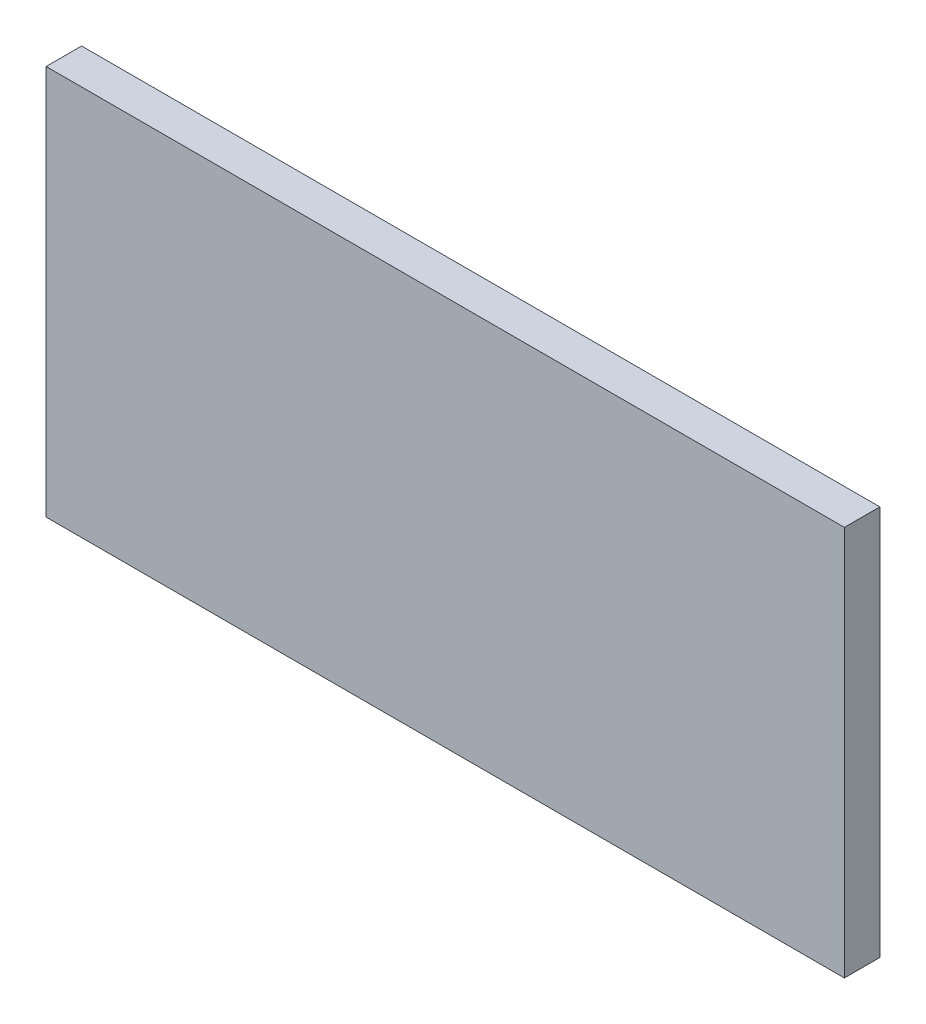
ISO-10303-21;
HEADER;
FILE_DESCRIPTION(('STEP AP214'),'2;1');
FILE_NAME('part.step','',(''),(''),'','','');
FILE_SCHEMA(('AUTOMOTIVE_DESIGN { 1 0 10303 214 1 1 1 1 }'));
ENDSEC;
DATA;
#1=APPLICATION_CONTEXT('core data for automotive mechanical design processes');
#2=APPLICATION_PROTOCOL_DEFINITION('international standard','automotive_design',2000,#1);
#3=PRODUCT_CONTEXT('',#1,'mechanical');
#4=PRODUCT('Part','Part','',(#3));
#5=PRODUCT_RELATED_PRODUCT_CATEGORY('part','',(#4));
#6=PRODUCT_DEFINITION_FORMATION('','',#4);
#7=PRODUCT_DEFINITION_CONTEXT('part definition',#1,'design');
#8=PRODUCT_DEFINITION('design','',#6,#7);
#9=PRODUCT_DEFINITION_SHAPE('','',#8);
#10=(LENGTH_UNIT() NAMED_UNIT(*) SI_UNIT(.MILLI.,.METRE.));
#11=(NAMED_UNIT(*) PLANE_ANGLE_UNIT() SI_UNIT($,.RADIAN.));
#12=(NAMED_UNIT(*) SI_UNIT($,.STERADIAN.) SOLID_ANGLE_UNIT());
#13=UNCERTAINTY_MEASURE_WITH_UNIT(LENGTH_MEASURE(1.E-05),#10,'distance_accuracy_value','');
#14=(GEOMETRIC_REPRESENTATION_CONTEXT(3) GLOBAL_UNCERTAINTY_ASSIGNED_CONTEXT((#13)) GLOBAL_UNIT_ASSIGNED_CONTEXT((#10,
#11,#12)) REPRESENTATION_CONTEXT('',''));
#15=CARTESIAN_POINT('',(0.,0.,0.));
#16=DIRECTION('',(0.,0.,1.));
#17=DIRECTION('',(1.,0.,0.));
#18=AXIS2_PLACEMENT_3D('',#15,#16,#17);
#19=CARTESIAN_POINT('',(-38.2975323983668,23.236641221374,4.));
#20=DIRECTION('',(1.,0.,0.));
#21=DIRECTION('',(0.,0.,-1.));
#22=AXIS2_PLACEMENT_3D('',#19,#20,#21);
#23=PLANE('',#22);
#24=DIRECTION('',(0.,-1.,0.));
#25=VECTOR('',#24,1.);
#26=CARTESIAN_POINT('',(-38.2975323983668,23.236641221374,0.));
#27=LINE('',#26,#25);
#28=CARTESIAN_POINT('',(-38.2975323983668,23.236641221374,0.));
#29=VERTEX_POINT('',#28);
#30=CARTESIAN_POINT('',(-38.2975323983668,-20.763358778626,0.));
#31=VERTEX_POINT('',#30);
#32=EDGE_CURVE('E107',#29,#31,#27,.T.);
#33=ORIENTED_EDGE('',*,*,#32,.T.);
#34=DIRECTION('',(0.,0.,-1.));
#35=VECTOR('',#34,1.);
#36=CARTESIAN_POINT('',(-38.2975323983668,-20.763358778626,4.));
#37=LINE('',#36,#35);
#38=CARTESIAN_POINT('',(-38.2975323983668,-20.763358778626,4.));
#39=VERTEX_POINT('',#38);
#40=EDGE_CURVE('E11',#39,#31,#37,.T.);
#41=ORIENTED_EDGE('',*,*,#40,.F.);
#42=DIRECTION('',(0.,-1.,0.));
#43=VECTOR('',#42,1.);
#44=CARTESIAN_POINT('',(-38.2975323983668,23.236641221374,4.));
#45=LINE('',#44,#43);
#46=CARTESIAN_POINT('',(-38.2975323983668,23.236641221374,4.));
#47=VERTEX_POINT('',#46);
#48=EDGE_CURVE('E91',#47,#39,#45,.T.);
#49=ORIENTED_EDGE('',*,*,#48,.F.);
#50=DIRECTION('',(0.,0.,-1.));
#51=VECTOR('',#50,1.);
#52=CARTESIAN_POINT('',(-38.2975323983668,23.236641221374,4.));
#53=LINE('',#52,#51);
#54=EDGE_CURVE('E103',#47,#29,#53,.T.);
#55=ORIENTED_EDGE('',*,*,#54,.T.);
#56=EDGE_LOOP('',(#33,#41,#49,#55));
#57=FACE_BOUND('',#56,.T.);
#58=ADVANCED_FACE('F39',(#57),#23,.F.);
#59=CARTESIAN_POINT('',(-38.2975323983668,-20.763358778626,4.));
#60=DIRECTION('',(0.,1.,0.));
#61=DIRECTION('',(0.,0.,1.));
#62=AXIS2_PLACEMENT_3D('',#59,#60,#61);
#63=PLANE('',#62);
#64=DIRECTION('',(1.,0.,0.));
#65=VECTOR('',#64,1.);
#66=CARTESIAN_POINT('',(-38.2975323983668,-20.763358778626,0.));
#67=LINE('',#66,#65);
#68=CARTESIAN_POINT('',(51.7024676016332,-20.763358778626,0.));
#69=VERTEX_POINT('',#68);
#70=EDGE_CURVE('E96',#31,#69,#67,.T.);
#71=ORIENTED_EDGE('',*,*,#70,.T.);
#72=DIRECTION('',(0.,0.,-1.));
#73=VECTOR('',#72,1.);
#74=CARTESIAN_POINT('',(51.7024676016332,-20.763358778626,4.));
#75=LINE('',#74,#73);
#76=CARTESIAN_POINT('',(51.7024676016332,-20.763358778626,4.));
#77=VERTEX_POINT('',#76);
#78=EDGE_CURVE('E48',#77,#69,#75,.T.);
#79=ORIENTED_EDGE('',*,*,#78,.F.);
#80=DIRECTION('',(1.,0.,0.));
#81=VECTOR('',#80,1.);
#82=CARTESIAN_POINT('',(-38.2975323983668,-20.763358778626,4.));
#83=LINE('',#82,#81);
#84=EDGE_CURVE('E86',#39,#77,#83,.T.);
#85=ORIENTED_EDGE('',*,*,#84,.F.);
#86=ORIENTED_EDGE('',*,*,#40,.T.);
#87=EDGE_LOOP('',(#71,#79,#85,#86));
#88=FACE_BOUND('',#87,.T.);
#89=ADVANCED_FACE('F95',(#88),#63,.F.);
#90=CARTESIAN_POINT('',(51.7024676016332,23.236641221374,4.));
#91=DIRECTION('',(-1.,0.,0.));
#92=DIRECTION('',(0.,0.,1.));
#93=AXIS2_PLACEMENT_3D('',#90,#91,#92);
#94=PLANE('',#93);
#95=DIRECTION('',(0.,1.,0.));
#96=VECTOR('',#95,1.);
#97=CARTESIAN_POINT('',(51.7024676016332,23.236641221374,0.));
#98=LINE('',#97,#96);
#99=CARTESIAN_POINT('',(51.7024676016332,23.236641221374,0.));
#100=VERTEX_POINT('',#99);
#101=EDGE_CURVE('E73',#69,#100,#98,.T.);
#102=ORIENTED_EDGE('',*,*,#101,.T.);
#103=DIRECTION('',(0.,0.,-1.));
#104=VECTOR('',#103,1.);
#105=CARTESIAN_POINT('',(51.7024676016332,23.236641221374,4.));
#106=LINE('',#105,#104);
#107=CARTESIAN_POINT('',(51.7024676016332,23.236641221374,4.));
#108=VERTEX_POINT('',#107);
#109=EDGE_CURVE('E98',#108,#100,#106,.T.);
#110=ORIENTED_EDGE('',*,*,#109,.F.);
#111=DIRECTION('',(0.,1.,0.));
#112=VECTOR('',#111,1.);
#113=CARTESIAN_POINT('',(51.7024676016332,23.236641221374,4.));
#114=LINE('',#113,#112);
#115=EDGE_CURVE('E89',#77,#108,#114,.T.);
#116=ORIENTED_EDGE('',*,*,#115,.F.);
#117=ORIENTED_EDGE('',*,*,#78,.T.);
#118=EDGE_LOOP('',(#102,#110,#116,#117));
#119=FACE_BOUND('',#118,.T.);
#120=ADVANCED_FACE('F99',(#119),#94,.F.);
#121=CARTESIAN_POINT('',(-38.2975323983668,23.236641221374,4.));
#122=DIRECTION('',(0.,-1.,0.));
#123=DIRECTION('',(0.,0.,-1.));
#124=AXIS2_PLACEMENT_3D('',#121,#122,#123);
#125=PLANE('',#124);
#126=DIRECTION('',(-1.,0.,0.));
#127=VECTOR('',#126,1.);
#128=CARTESIAN_POINT('',(-38.2975323983668,23.236641221374,0.));
#129=LINE('',#128,#127);
#130=EDGE_CURVE('E79',#100,#29,#129,.T.);
#131=ORIENTED_EDGE('',*,*,#130,.T.);
#132=ORIENTED_EDGE('',*,*,#54,.F.);
#133=DIRECTION('',(-1.,0.,0.));
#134=VECTOR('',#133,1.);
#135=CARTESIAN_POINT('',(-38.2975323983668,23.236641221374,4.));
#136=LINE('',#135,#134);
#137=EDGE_CURVE('E56',#108,#47,#136,.T.);
#138=ORIENTED_EDGE('',*,*,#137,.F.);
#139=ORIENTED_EDGE('',*,*,#109,.T.);
#140=EDGE_LOOP('',(#131,#132,#138,#139));
#141=FACE_BOUND('',#140,.T.);
#142=ADVANCED_FACE('F120',(#141),#125,.F.);
#143=CARTESIAN_POINT('',(0.,0.,4.));
#144=DIRECTION('',(0.,0.,1.));
#145=DIRECTION('',(1.,0.,0.));
#146=AXIS2_PLACEMENT_3D('',#143,#144,#145);
#147=PLANE('',#146);
#148=ORIENTED_EDGE('',*,*,#48,.T.);
#149=ORIENTED_EDGE('',*,*,#84,.T.);
#150=ORIENTED_EDGE('',*,*,#115,.T.);
#151=ORIENTED_EDGE('',*,*,#137,.T.);
#152=EDGE_LOOP('',(#148,#149,#150,#151));
#153=FACE_BOUND('',#152,.T.);
#154=ADVANCED_FACE('F87',(#153),#147,.T.);
#155=CARTESIAN_POINT('',(0.,0.,0.));
#156=DIRECTION('',(0.,0.,1.));
#157=DIRECTION('',(1.,0.,0.));
#158=AXIS2_PLACEMENT_3D('',#155,#156,#157);
#159=PLANE('',#158);
#160=ORIENTED_EDGE('',*,*,#32,.F.);
#161=ORIENTED_EDGE('',*,*,#130,.F.);
#162=ORIENTED_EDGE('',*,*,#101,.F.);
#163=ORIENTED_EDGE('',*,*,#70,.F.);
#164=EDGE_LOOP('',(#160,#161,#162,#163));
#165=FACE_BOUND('',#164,.T.);
#166=ADVANCED_FACE('F123',(#165),#159,.F.);
#167=CLOSED_SHELL('',(#58,#89,#120,#142,#154,#166));
#168=MANIFOLD_SOLID_BREP('B2',#167);
#169=ADVANCED_BREP_SHAPE_REPRESENTATION('',(#18,#168),#14);
#170=SHAPE_DEFINITION_REPRESENTATION(#9,#169);
ENDSEC;
END-ISO-10303-21;
